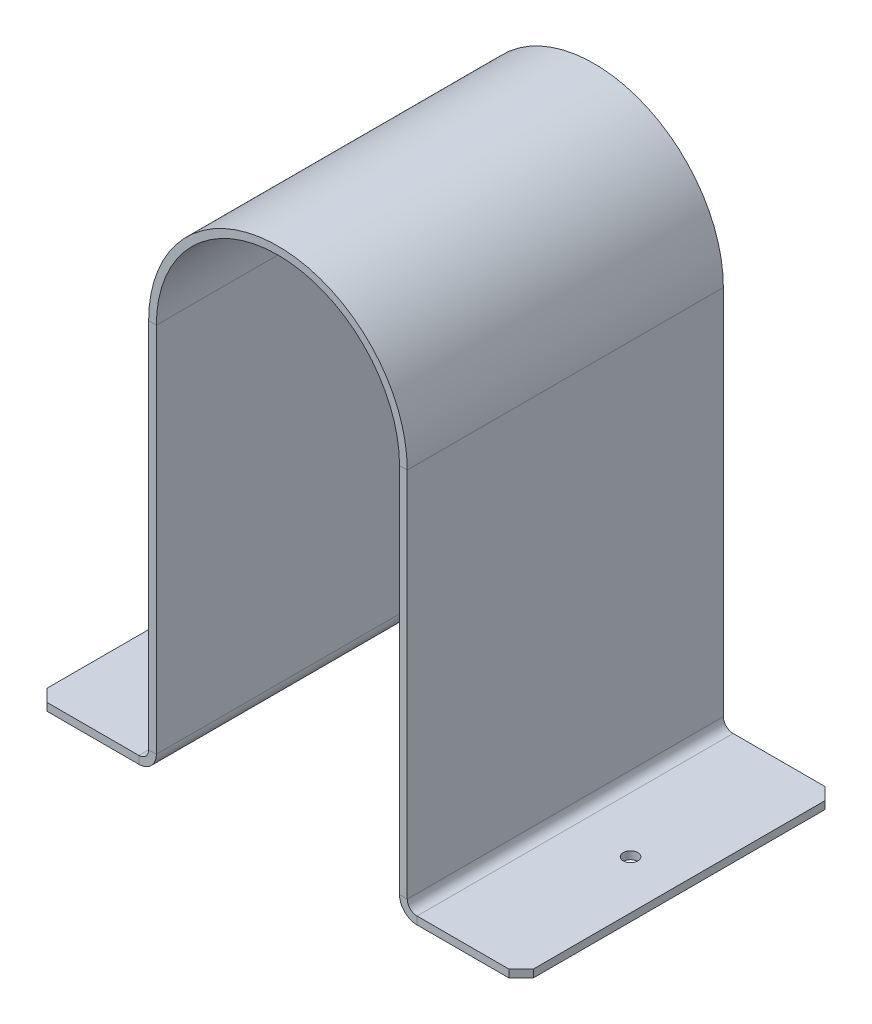
ISO-10303-21;
HEADER;
FILE_DESCRIPTION(('STEP AP214'),'2;1');
FILE_NAME('part.step','',(''),(''),'','','');
FILE_SCHEMA(('AUTOMOTIVE_DESIGN { 1 0 10303 214 1 1 1 1 }'));
ENDSEC;
DATA;
#1=APPLICATION_CONTEXT('core data for automotive mechanical design processes');
#2=APPLICATION_PROTOCOL_DEFINITION('international standard','automotive_design',2000,#1);
#3=PRODUCT_CONTEXT('',#1,'mechanical');
#4=PRODUCT('Part','Part','',(#3));
#5=PRODUCT_RELATED_PRODUCT_CATEGORY('part','',(#4));
#6=PRODUCT_DEFINITION_FORMATION('','',#4);
#7=PRODUCT_DEFINITION_CONTEXT('part definition',#1,'design');
#8=PRODUCT_DEFINITION('design','',#6,#7);
#9=PRODUCT_DEFINITION_SHAPE('','',#8);
#10=(LENGTH_UNIT() NAMED_UNIT(*) SI_UNIT(.MILLI.,.METRE.));
#11=(NAMED_UNIT(*) PLANE_ANGLE_UNIT() SI_UNIT($,.RADIAN.));
#12=(NAMED_UNIT(*) SI_UNIT($,.STERADIAN.) SOLID_ANGLE_UNIT());
#13=UNCERTAINTY_MEASURE_WITH_UNIT(LENGTH_MEASURE(1.E-05),#10,'distance_accuracy_value','');
#14=(GEOMETRIC_REPRESENTATION_CONTEXT(3) GLOBAL_UNCERTAINTY_ASSIGNED_CONTEXT((#13)) GLOBAL_UNIT_ASSIGNED_CONTEXT((#10,
#11,#12)) REPRESENTATION_CONTEXT('',''));
#15=CARTESIAN_POINT('',(0.,0.,0.));
#16=DIRECTION('',(0.,0.,1.));
#17=DIRECTION('',(1.,0.,0.));
#18=AXIS2_PLACEMENT_3D('',#15,#16,#17);
#19=CARTESIAN_POINT('',(-50.,160.,65.));
#20=DIRECTION('',(0.,0.,1.));
#21=DIRECTION('',(1.,0.,0.));
#22=AXIS2_PLACEMENT_3D('',#19,#20,#21);
#23=PLANE('',#22);
#24=DIRECTION('',(-1.,0.,0.));
#25=VECTOR('',#24,1.);
#26=CARTESIAN_POINT('',(-50.,160.,65.));
#27=LINE('',#26,#25);
#28=CARTESIAN_POINT('',(-50.,160.,65.));
#29=VERTEX_POINT('',#28);
#30=CARTESIAN_POINT('',(-53.175,160.,65.));
#31=VERTEX_POINT('',#30);
#32=EDGE_CURVE('E350',#29,#31,#27,.T.);
#33=ORIENTED_EDGE('',*,*,#32,.F.);
#34=CARTESIAN_POINT('',(0.,160.,65.));
#35=DIRECTION('',(0.,0.,-1.));
#36=DIRECTION('',(-1.,0.,0.));
#37=AXIS2_PLACEMENT_3D('',#34,#35,#36);
#38=CIRCLE('',#37,50.);
#39=CARTESIAN_POINT('',(50.,160.,65.));
#40=VERTEX_POINT('',#39);
#41=EDGE_CURVE('E246',#29,#40,#38,.T.);
#42=ORIENTED_EDGE('',*,*,#41,.T.);
#43=DIRECTION('',(-1.,0.,0.));
#44=VECTOR('',#43,1.);
#45=CARTESIAN_POINT('',(53.175,160.,65.));
#46=LINE('',#45,#44);
#47=CARTESIAN_POINT('',(53.175,160.,65.));
#48=VERTEX_POINT('',#47);
#49=EDGE_CURVE('E348',#48,#40,#46,.T.);
#50=ORIENTED_EDGE('',*,*,#49,.F.);
#51=CARTESIAN_POINT('',(0.,160.,65.));
#52=DIRECTION('',(0.,0.,1.));
#53=DIRECTION('',(1.,0.,0.));
#54=AXIS2_PLACEMENT_3D('',#51,#52,#53);
#55=CIRCLE('',#54,53.175);
#56=EDGE_CURVE('E224',#31,#48,#55,.F.);
#57=ORIENTED_EDGE('',*,*,#56,.F.);
#58=EDGE_LOOP('',(#33,#42,#50,#57));
#59=FACE_BOUND('',#58,.T.);
#60=ADVANCED_FACE('F43',(#59),#23,.T.);
#61=CARTESIAN_POINT('',(53.175,160.,65.));
#62=DIRECTION('',(0.,0.,1.));
#63=DIRECTION('',(1.,0.,0.));
#64=AXIS2_PLACEMENT_3D('',#61,#62,#63);
#65=PLANE('',#64);
#66=DIRECTION('',(0.,1.,0.));
#67=VECTOR('',#66,1.);
#68=CARTESIAN_POINT('',(-50.,0.,65.));
#69=LINE('',#68,#67);
#70=CARTESIAN_POINT('',(-50.,7.175,65.));
#71=VERTEX_POINT('',#70);
#72=EDGE_CURVE('E243',#71,#29,#69,.T.);
#73=ORIENTED_EDGE('',*,*,#72,.T.);
#74=ORIENTED_EDGE('',*,*,#32,.T.);
#75=DIRECTION('',(0.,1.,0.));
#76=VECTOR('',#75,1.);
#77=CARTESIAN_POINT('',(-53.175,0.,65.));
#78=LINE('',#77,#76);
#79=CARTESIAN_POINT('',(-53.175,7.175,65.));
#80=VERTEX_POINT('',#79);
#81=EDGE_CURVE('E230',#80,#31,#78,.T.);
#82=ORIENTED_EDGE('',*,*,#81,.F.);
#83=DIRECTION('',(1.,0.,0.));
#84=VECTOR('',#83,1.);
#85=CARTESIAN_POINT('',(-53.175,7.175,65.));
#86=LINE('',#85,#84);
#87=EDGE_CURVE('E339',#80,#71,#86,.T.);
#88=ORIENTED_EDGE('',*,*,#87,.T.);
#89=EDGE_LOOP('',(#73,#74,#82,#88));
#90=FACE_BOUND('',#89,.T.);
#91=ADVANCED_FACE('F421',(#90),#65,.T.);
#92=CARTESIAN_POINT('',(50.,160.,-65.));
#93=DIRECTION('',(0.,0.,-1.));
#94=DIRECTION('',(-1.,0.,0.));
#95=AXIS2_PLACEMENT_3D('',#92,#93,#94);
#96=PLANE('',#95);
#97=DIRECTION('',(1.,0.,0.));
#98=VECTOR('',#97,1.);
#99=CARTESIAN_POINT('',(50.,160.,-65.));
#100=LINE('',#99,#98);
#101=CARTESIAN_POINT('',(50.,160.,-65.));
#102=VERTEX_POINT('',#101);
#103=CARTESIAN_POINT('',(53.175,160.,-65.));
#104=VERTEX_POINT('',#103);
#105=EDGE_CURVE('E346',#102,#104,#100,.T.);
#106=ORIENTED_EDGE('',*,*,#105,.F.);
#107=CARTESIAN_POINT('',(0.,160.,-65.));
#108=DIRECTION('',(0.,0.,-1.));
#109=DIRECTION('',(-1.,0.,0.));
#110=AXIS2_PLACEMENT_3D('',#107,#108,#109);
#111=CIRCLE('',#110,50.);
#112=CARTESIAN_POINT('',(-50.,160.,-65.));
#113=VERTEX_POINT('',#112);
#114=EDGE_CURVE('E283',#113,#102,#111,.T.);
#115=ORIENTED_EDGE('',*,*,#114,.F.);
#116=DIRECTION('',(1.,0.,0.));
#117=VECTOR('',#116,1.);
#118=CARTESIAN_POINT('',(-53.175,160.,-65.));
#119=LINE('',#118,#117);
#120=CARTESIAN_POINT('',(-53.175,160.,-65.));
#121=VERTEX_POINT('',#120);
#122=EDGE_CURVE('E344',#121,#113,#119,.T.);
#123=ORIENTED_EDGE('',*,*,#122,.F.);
#124=CARTESIAN_POINT('',(0.,160.,-65.));
#125=DIRECTION('',(0.,0.,1.));
#126=DIRECTION('',(1.,0.,0.));
#127=AXIS2_PLACEMENT_3D('',#124,#125,#126);
#128=CIRCLE('',#127,53.175);
#129=EDGE_CURVE('E264',#121,#104,#128,.F.);
#130=ORIENTED_EDGE('',*,*,#129,.T.);
#131=EDGE_LOOP('',(#106,#115,#123,#130));
#132=FACE_BOUND('',#131,.T.);
#133=ADVANCED_FACE('F479',(#132),#96,.T.);
#134=CARTESIAN_POINT('',(-53.175,160.,-65.));
#135=DIRECTION('',(0.,0.,-1.));
#136=DIRECTION('',(-1.,0.,0.));
#137=AXIS2_PLACEMENT_3D('',#134,#135,#136);
#138=PLANE('',#137);
#139=DIRECTION('',(0.,-1.,0.));
#140=VECTOR('',#139,1.);
#141=CARTESIAN_POINT('',(50.,160.,-65.));
#142=LINE('',#141,#140);
#143=CARTESIAN_POINT('',(50.,7.17499999999999,-65.));
#144=VERTEX_POINT('',#143);
#145=EDGE_CURVE('E286',#102,#144,#142,.T.);
#146=ORIENTED_EDGE('',*,*,#145,.F.);
#147=ORIENTED_EDGE('',*,*,#105,.T.);
#148=DIRECTION('',(0.,-1.,0.));
#149=VECTOR('',#148,1.);
#150=CARTESIAN_POINT('',(53.175,160.,-65.));
#151=LINE('',#150,#149);
#152=CARTESIAN_POINT('',(53.175,7.17499999999999,-65.));
#153=VERTEX_POINT('',#152);
#154=EDGE_CURVE('E261',#104,#153,#151,.T.);
#155=ORIENTED_EDGE('',*,*,#154,.T.);
#156=DIRECTION('',(-1.,0.,0.));
#157=VECTOR('',#156,1.);
#158=CARTESIAN_POINT('',(53.175,7.17499999999999,-65.));
#159=LINE('',#158,#157);
#160=EDGE_CURVE('E330',#153,#144,#159,.T.);
#161=ORIENTED_EDGE('',*,*,#160,.T.);
#162=EDGE_LOOP('',(#146,#147,#155,#161));
#163=FACE_BOUND('',#162,.T.);
#164=ADVANCED_FACE('F784',(#163),#138,.T.);
#165=CARTESIAN_POINT('',(-57.175,0.,65.));
#166=DIRECTION('',(0.,0.,1.));
#167=DIRECTION('',(1.,0.,0.));
#168=AXIS2_PLACEMENT_3D('',#165,#166,#167);
#169=PLANE('',#168);
#170=DIRECTION('',(0.,1.,0.));
#171=VECTOR('',#170,1.);
#172=CARTESIAN_POINT('',(-57.175,0.,65.));
#173=LINE('',#172,#171);
#174=CARTESIAN_POINT('',(-57.175,0.,65.));
#175=VERTEX_POINT('',#174);
#176=CARTESIAN_POINT('',(-57.175,3.175,65.));
#177=VERTEX_POINT('',#176);
#178=EDGE_CURVE('E341',#175,#177,#173,.T.);
#179=ORIENTED_EDGE('',*,*,#178,.F.);
#180=CARTESIAN_POINT('',(-57.175,7.175,65.));
#181=DIRECTION('',(0.,0.,-1.));
#182=DIRECTION('',(-1.,0.,0.));
#183=AXIS2_PLACEMENT_3D('',#180,#181,#182);
#184=CIRCLE('',#183,7.175);
#185=EDGE_CURVE('E240',#175,#71,#184,.F.);
#186=ORIENTED_EDGE('',*,*,#185,.T.);
#187=ORIENTED_EDGE('',*,*,#87,.F.);
#188=CARTESIAN_POINT('',(-57.175,7.175,65.));
#189=DIRECTION('',(0.,0.,1.));
#190=DIRECTION('',(1.,0.,0.));
#191=AXIS2_PLACEMENT_3D('',#188,#189,#190);
#192=CIRCLE('',#191,4.);
#193=EDGE_CURVE('E233',#177,#80,#192,.T.);
#194=ORIENTED_EDGE('',*,*,#193,.F.);
#195=EDGE_LOOP('',(#179,#186,#187,#194));
#196=FACE_BOUND('',#195,.T.);
#197=ADVANCED_FACE('F412',(#196),#169,.T.);
#198=CARTESIAN_POINT('',(-53.175,7.175,65.));
#199=DIRECTION('',(0.,0.,1.));
#200=DIRECTION('',(1.,0.,0.));
#201=AXIS2_PLACEMENT_3D('',#198,#199,#200);
#202=PLANE('',#201);
#203=DIRECTION('',(1.,0.,0.));
#204=VECTOR('',#203,1.);
#205=CARTESIAN_POINT('',(-100.,3.175,65.));
#206=LINE('',#205,#204);
#207=CARTESIAN_POINT('',(-95.,3.175,65.));
#208=VERTEX_POINT('',#207);
#209=EDGE_CURVE('E236',#208,#177,#206,.T.);
#210=ORIENTED_EDGE('',*,*,#209,.F.);
#211=DIRECTION('',(0.,-1.,0.));
#212=VECTOR('',#211,1.);
#213=CARTESIAN_POINT('',(-95.,7.175,65.));
#214=LINE('',#213,#212);
#215=CARTESIAN_POINT('',(-95.,0.,65.));
#216=VERTEX_POINT('',#215);
#217=EDGE_CURVE('E11',#208,#216,#214,.T.);
#218=ORIENTED_EDGE('',*,*,#217,.T.);
#219=DIRECTION('',(1.,0.,0.));
#220=VECTOR('',#219,1.);
#221=CARTESIAN_POINT('',(-100.,0.,65.));
#222=LINE('',#221,#220);
#223=EDGE_CURVE('E238',#216,#175,#222,.T.);
#224=ORIENTED_EDGE('',*,*,#223,.T.);
#225=ORIENTED_EDGE('',*,*,#178,.T.);
#226=EDGE_LOOP('',(#210,#218,#224,#225));
#227=FACE_BOUND('',#226,.T.);
#228=ADVANCED_FACE('F404',(#227),#202,.T.);
#229=CARTESIAN_POINT('',(-50.,7.175,-65.));
#230=DIRECTION('',(0.,0.,-1.));
#231=DIRECTION('',(-1.,0.,0.));
#232=AXIS2_PLACEMENT_3D('',#229,#230,#231);
#233=PLANE('',#232);
#234=DIRECTION('',(-1.,0.,0.));
#235=VECTOR('',#234,1.);
#236=CARTESIAN_POINT('',(-50.,7.175,-65.));
#237=LINE('',#236,#235);
#238=CARTESIAN_POINT('',(-50.,7.175,-65.));
#239=VERTEX_POINT('',#238);
#240=CARTESIAN_POINT('',(-53.175,7.175,-65.));
#241=VERTEX_POINT('',#240);
#242=EDGE_CURVE('E337',#239,#241,#237,.T.);
#243=ORIENTED_EDGE('',*,*,#242,.F.);
#244=CARTESIAN_POINT('',(-57.175,7.175,-65.));
#245=DIRECTION('',(0.,0.,-1.));
#246=DIRECTION('',(-1.,0.,0.));
#247=AXIS2_PLACEMENT_3D('',#244,#245,#246);
#248=CIRCLE('',#247,7.175);
#249=CARTESIAN_POINT('',(-57.175,0.,-65.));
#250=VERTEX_POINT('',#249);
#251=EDGE_CURVE('E277',#250,#239,#248,.F.);
#252=ORIENTED_EDGE('',*,*,#251,.F.);
#253=DIRECTION('',(0.,-1.,0.));
#254=VECTOR('',#253,1.);
#255=CARTESIAN_POINT('',(-57.175,3.175,-65.));
#256=LINE('',#255,#254);
#257=CARTESIAN_POINT('',(-57.175,3.175,-65.));
#258=VERTEX_POINT('',#257);
#259=EDGE_CURVE('E334',#258,#250,#256,.T.);
#260=ORIENTED_EDGE('',*,*,#259,.F.);
#261=CARTESIAN_POINT('',(-57.175,7.175,-65.));
#262=DIRECTION('',(0.,0.,1.));
#263=DIRECTION('',(1.,0.,0.));
#264=AXIS2_PLACEMENT_3D('',#261,#262,#263);
#265=CIRCLE('',#264,4.);
#266=EDGE_CURVE('E270',#258,#241,#265,.T.);
#267=ORIENTED_EDGE('',*,*,#266,.T.);
#268=EDGE_LOOP('',(#243,#252,#260,#267));
#269=FACE_BOUND('',#268,.T.);
#270=ADVANCED_FACE('F626',(#269),#233,.T.);
#271=CARTESIAN_POINT('',(-57.175,3.175,-65.));
#272=DIRECTION('',(0.,0.,-1.));
#273=DIRECTION('',(-1.,0.,0.));
#274=AXIS2_PLACEMENT_3D('',#271,#272,#273);
#275=PLANE('',#274);
#276=DIRECTION('',(0.,1.,0.));
#277=VECTOR('',#276,1.);
#278=CARTESIAN_POINT('',(-50.,0.,-65.));
#279=LINE('',#278,#277);
#280=EDGE_CURVE('E280',#239,#113,#279,.T.);
#281=ORIENTED_EDGE('',*,*,#280,.F.);
#282=ORIENTED_EDGE('',*,*,#242,.T.);
#283=DIRECTION('',(0.,1.,0.));
#284=VECTOR('',#283,1.);
#285=CARTESIAN_POINT('',(-53.175,0.,-65.));
#286=LINE('',#285,#284);
#287=EDGE_CURVE('E267',#241,#121,#286,.T.);
#288=ORIENTED_EDGE('',*,*,#287,.T.);
#289=ORIENTED_EDGE('',*,*,#122,.T.);
#290=EDGE_LOOP('',(#281,#282,#288,#289));
#291=FACE_BOUND('',#290,.T.);
#292=ADVANCED_FACE('F758',(#291),#275,.T.);
#293=CARTESIAN_POINT('',(50.,7.17499999999999,65.));
#294=DIRECTION('',(0.,0.,1.));
#295=DIRECTION('',(1.,0.,0.));
#296=AXIS2_PLACEMENT_3D('',#293,#294,#295);
#297=PLANE('',#296);
#298=DIRECTION('',(1.,0.,0.));
#299=VECTOR('',#298,1.);
#300=CARTESIAN_POINT('',(50.,7.17499999999999,65.));
#301=LINE('',#300,#299);
#302=CARTESIAN_POINT('',(50.,7.17499999999999,65.));
#303=VERTEX_POINT('',#302);
#304=CARTESIAN_POINT('',(53.175,7.17499999999999,65.));
#305=VERTEX_POINT('',#304);
#306=EDGE_CURVE('E194',#303,#305,#301,.T.);
#307=ORIENTED_EDGE('',*,*,#306,.F.);
#308=CARTESIAN_POINT('',(57.175,7.17499999999999,65.));
#309=DIRECTION('',(0.,0.,-1.));
#310=DIRECTION('',(-1.,0.,0.));
#311=AXIS2_PLACEMENT_3D('',#308,#309,#310);
#312=CIRCLE('',#311,7.175);
#313=CARTESIAN_POINT('',(57.175,0.,65.));
#314=VERTEX_POINT('',#313);
#315=EDGE_CURVE('E189',#303,#314,#312,.F.);
#316=ORIENTED_EDGE('',*,*,#315,.T.);
#317=DIRECTION('',(0.,-1.,0.));
#318=VECTOR('',#317,1.);
#319=CARTESIAN_POINT('',(57.175,3.175,65.));
#320=LINE('',#319,#318);
#321=CARTESIAN_POINT('',(57.175,3.175,65.));
#322=VERTEX_POINT('',#321);
#323=EDGE_CURVE('E182',#322,#314,#320,.T.);
#324=ORIENTED_EDGE('',*,*,#323,.F.);
#325=CARTESIAN_POINT('',(57.175,7.17499999999999,65.));
#326=DIRECTION('',(0.,0.,1.));
#327=DIRECTION('',(1.,0.,0.));
#328=AXIS2_PLACEMENT_3D('',#325,#326,#327);
#329=CIRCLE('',#328,4.);
#330=EDGE_CURVE('E186',#305,#322,#329,.T.);
#331=ORIENTED_EDGE('',*,*,#330,.F.);
#332=EDGE_LOOP('',(#307,#316,#324,#331));
#333=FACE_BOUND('',#332,.T.);
#334=ADVANCED_FACE('F184',(#333),#297,.T.);
#335=CARTESIAN_POINT('',(57.175,3.175,65.));
#336=DIRECTION('',(0.,0.,1.));
#337=DIRECTION('',(1.,0.,0.));
#338=AXIS2_PLACEMENT_3D('',#335,#336,#337);
#339=PLANE('',#338);
#340=DIRECTION('',(0.,-1.,0.));
#341=VECTOR('',#340,1.);
#342=CARTESIAN_POINT('',(50.,160.,65.));
#343=LINE('',#342,#341);
#344=EDGE_CURVE('E249',#40,#303,#343,.T.);
#345=ORIENTED_EDGE('',*,*,#344,.T.);
#346=ORIENTED_EDGE('',*,*,#306,.T.);
#347=DIRECTION('',(0.,-1.,0.));
#348=VECTOR('',#347,1.);
#349=CARTESIAN_POINT('',(53.175,160.,65.));
#350=LINE('',#349,#348);
#351=EDGE_CURVE('E222',#48,#305,#350,.T.);
#352=ORIENTED_EDGE('',*,*,#351,.F.);
#353=ORIENTED_EDGE('',*,*,#49,.T.);
#354=EDGE_LOOP('',(#345,#346,#352,#353));
#355=FACE_BOUND('',#354,.T.);
#356=ADVANCED_FACE('F438',(#355),#339,.T.);
#357=CARTESIAN_POINT('',(57.175,0.,-65.));
#358=DIRECTION('',(0.,0.,-1.));
#359=DIRECTION('',(-1.,0.,0.));
#360=AXIS2_PLACEMENT_3D('',#357,#358,#359);
#361=PLANE('',#360);
#362=DIRECTION('',(0.,1.,0.));
#363=VECTOR('',#362,1.);
#364=CARTESIAN_POINT('',(57.175,0.,-65.));
#365=LINE('',#364,#363);
#366=CARTESIAN_POINT('',(57.175,0.,-65.));
#367=VERTEX_POINT('',#366);
#368=CARTESIAN_POINT('',(57.175,3.175,-65.));
#369=VERTEX_POINT('',#368);
#370=EDGE_CURVE('E195',#367,#369,#365,.T.);
#371=ORIENTED_EDGE('',*,*,#370,.F.);
#372=CARTESIAN_POINT('',(57.175,7.17499999999999,-65.));
#373=DIRECTION('',(0.,0.,-1.));
#374=DIRECTION('',(-1.,0.,0.));
#375=AXIS2_PLACEMENT_3D('',#372,#373,#374);
#376=CIRCLE('',#375,7.175);
#377=EDGE_CURVE('E289',#144,#367,#376,.F.);
#378=ORIENTED_EDGE('',*,*,#377,.F.);
#379=ORIENTED_EDGE('',*,*,#160,.F.);
#380=CARTESIAN_POINT('',(57.175,7.17499999999999,-65.));
#381=DIRECTION('',(0.,0.,1.));
#382=DIRECTION('',(1.,0.,0.));
#383=AXIS2_PLACEMENT_3D('',#380,#381,#382);
#384=CIRCLE('',#383,4.);
#385=EDGE_CURVE('E259',#153,#369,#384,.T.);
#386=ORIENTED_EDGE('',*,*,#385,.T.);
#387=EDGE_LOOP('',(#371,#378,#379,#386));
#388=FACE_BOUND('',#387,.T.);
#389=ADVANCED_FACE('F613',(#388),#361,.T.);
#390=CARTESIAN_POINT('',(53.175,7.17499999999999,-65.));
#391=DIRECTION('',(0.,0.,-1.));
#392=DIRECTION('',(-1.,0.,0.));
#393=AXIS2_PLACEMENT_3D('',#390,#391,#392);
#394=PLANE('',#393);
#395=DIRECTION('',(1.,0.,0.));
#396=VECTOR('',#395,1.);
#397=CARTESIAN_POINT('',(50.,3.175,-65.));
#398=LINE('',#397,#396);
#399=CARTESIAN_POINT('',(95.,3.175,-65.));
#400=VERTEX_POINT('',#399);
#401=EDGE_CURVE('E207',#369,#400,#398,.T.);
#402=ORIENTED_EDGE('',*,*,#401,.T.);
#403=DIRECTION('',(0.,-1.,0.));
#404=VECTOR('',#403,1.);
#405=CARTESIAN_POINT('',(95.,7.17499999999999,-65.));
#406=LINE('',#405,#404);
#407=CARTESIAN_POINT('',(95.,0.,-65.));
#408=VERTEX_POINT('',#407);
#409=EDGE_CURVE('E352',#400,#408,#406,.T.);
#410=ORIENTED_EDGE('',*,*,#409,.T.);
#411=DIRECTION('',(1.,0.,0.));
#412=VECTOR('',#411,1.);
#413=CARTESIAN_POINT('',(50.,0.,-65.));
#414=LINE('',#413,#412);
#415=EDGE_CURVE('E254',#367,#408,#414,.T.);
#416=ORIENTED_EDGE('',*,*,#415,.F.);
#417=ORIENTED_EDGE('',*,*,#370,.T.);
#418=EDGE_LOOP('',(#402,#410,#416,#417));
#419=FACE_BOUND('',#418,.T.);
#420=ADVANCED_FACE('F602',(#419),#394,.T.);
#421=CARTESIAN_POINT('',(50.,0.,65.));
#422=DIRECTION('',(0.,1.,0.));
#423=DIRECTION('',(0.,0.,1.));
#424=AXIS2_PLACEMENT_3D('',#421,#422,#423);
#425=PLANE('',#424);
#426=CARTESIAN_POINT('',(80.,0.,0.));
#427=DIRECTION('',(0.,1.,0.));
#428=DIRECTION('',(0.,0.,1.));
#429=AXIS2_PLACEMENT_3D('',#426,#427,#428);
#430=CIRCLE('',#429,3.00000000000001);
#431=CARTESIAN_POINT('',(80.,0.,3.00000000000001));
#432=VERTEX_POINT('',#431);
#433=EDGE_CURVE('E257',#432,#432,#430,.T.);
#434=ORIENTED_EDGE('',*,*,#433,.T.);
#435=EDGE_LOOP('',(#434));
#436=FACE_BOUND('',#435,.T.);
#437=ORIENTED_EDGE('',*,*,#415,.T.);
#438=DIRECTION('',(-0.707106781186548,0.,-0.707106781186548));
#439=VECTOR('',#438,1.);
#440=CARTESIAN_POINT('',(95.,0.,-65.));
#441=LINE('',#440,#439);
#442=CARTESIAN_POINT('',(100.,0.,-60.));
#443=VERTEX_POINT('',#442);
#444=EDGE_CURVE('E361',#408,#443,#441,.F.);
#445=ORIENTED_EDGE('',*,*,#444,.T.);
#446=DIRECTION('',(0.,0.,-1.));
#447=VECTOR('',#446,1.);
#448=CARTESIAN_POINT('',(100.,0.,65.));
#449=LINE('',#448,#447);
#450=CARTESIAN_POINT('',(100.,0.,60.));
#451=VERTEX_POINT('',#450);
#452=EDGE_CURVE('E327',#451,#443,#449,.T.);
#453=ORIENTED_EDGE('',*,*,#452,.F.);
#454=DIRECTION('',(0.707106781186548,0.,-0.707106781186548));
#455=VECTOR('',#454,1.);
#456=CARTESIAN_POINT('',(100.,0.,60.));
#457=LINE('',#456,#455);
#458=CARTESIAN_POINT('',(95.,0.,65.));
#459=VERTEX_POINT('',#458);
#460=EDGE_CURVE('E359',#451,#459,#457,.F.);
#461=ORIENTED_EDGE('',*,*,#460,.T.);
#462=DIRECTION('',(1.,0.,0.));
#463=VECTOR('',#462,1.);
#464=CARTESIAN_POINT('',(50.,0.,65.));
#465=LINE('',#464,#463);
#466=EDGE_CURVE('E217',#314,#459,#465,.T.);
#467=ORIENTED_EDGE('',*,*,#466,.F.);
#468=DIRECTION('',(0.,0.,-1.));
#469=VECTOR('',#468,1.);
#470=CARTESIAN_POINT('',(57.175,0.,65.));
#471=LINE('',#470,#469);
#472=EDGE_CURVE('E253',#314,#367,#471,.T.);
#473=ORIENTED_EDGE('',*,*,#472,.T.);
#474=EDGE_LOOP('',(#437,#445,#453,#461,#467,#473));
#475=FACE_BOUND('',#474,.T.);
#476=ADVANCED_FACE('F450',(#436,#475),#425,.F.);
#477=CARTESIAN_POINT('',(100.,3.175,65.));
#478=DIRECTION('',(1.,0.,0.));
#479=DIRECTION('',(0.,0.,-1.));
#480=AXIS2_PLACEMENT_3D('',#477,#478,#479);
#481=PLANE('',#480);
#482=ORIENTED_EDGE('',*,*,#452,.T.);
#483=DIRECTION('',(0.,1.,0.));
#484=VECTOR('',#483,1.);
#485=CARTESIAN_POINT('',(100.,3.175,-60.));
#486=LINE('',#485,#484);
#487=CARTESIAN_POINT('',(100.,3.175,-60.));
#488=VERTEX_POINT('',#487);
#489=EDGE_CURVE('E366',#443,#488,#486,.T.);
#490=ORIENTED_EDGE('',*,*,#489,.T.);
#491=DIRECTION('',(0.,0.,-1.));
#492=VECTOR('',#491,1.);
#493=CARTESIAN_POINT('',(100.,3.175,65.));
#494=LINE('',#493,#492);
#495=CARTESIAN_POINT('',(100.,3.175,60.));
#496=VERTEX_POINT('',#495);
#497=EDGE_CURVE('E211',#496,#488,#494,.T.);
#498=ORIENTED_EDGE('',*,*,#497,.F.);
#499=DIRECTION('',(0.,-1.,0.));
#500=VECTOR('',#499,1.);
#501=CARTESIAN_POINT('',(100.,3.175,60.));
#502=LINE('',#501,#500);
#503=EDGE_CURVE('E363',#496,#451,#502,.T.);
#504=ORIENTED_EDGE('',*,*,#503,.T.);
#505=EDGE_LOOP('',(#482,#490,#498,#504));
#506=FACE_BOUND('',#505,.T.);
#507=ADVANCED_FACE('F465',(#506),#481,.T.);
#508=CARTESIAN_POINT('',(50.,3.175,65.));
#509=DIRECTION('',(0.,1.,0.));
#510=DIRECTION('',(0.,0.,1.));
#511=AXIS2_PLACEMENT_3D('',#508,#509,#510);
#512=PLANE('',#511);
#513=CARTESIAN_POINT('',(80.,3.175,0.));
#514=DIRECTION('',(0.,1.,0.));
#515=DIRECTION('',(0.,0.,1.));
#516=AXIS2_PLACEMENT_3D('',#513,#514,#515);
#517=CIRCLE('',#516,3.00000000000001);
#518=CARTESIAN_POINT('',(80.,3.175,3.00000000000001));
#519=VERTEX_POINT('',#518);
#520=EDGE_CURVE('E356',#519,#519,#517,.T.);
#521=ORIENTED_EDGE('',*,*,#520,.F.);
#522=EDGE_LOOP('',(#521));
#523=FACE_BOUND('',#522,.T.);
#524=ORIENTED_EDGE('',*,*,#497,.T.);
#525=DIRECTION('',(0.707106781186548,0.,0.707106781186548));
#526=VECTOR('',#525,1.);
#527=CARTESIAN_POINT('',(137.5,3.175,-22.5));
#528=LINE('',#527,#526);
#529=EDGE_CURVE('E370',#488,#400,#528,.F.);
#530=ORIENTED_EDGE('',*,*,#529,.T.);
#531=ORIENTED_EDGE('',*,*,#401,.F.);
#532=DIRECTION('',(0.,0.,-1.));
#533=VECTOR('',#532,1.);
#534=CARTESIAN_POINT('',(57.175,3.175,65.));
#535=LINE('',#534,#533);
#536=EDGE_CURVE('E201',#322,#369,#535,.T.);
#537=ORIENTED_EDGE('',*,*,#536,.F.);
#538=DIRECTION('',(1.,0.,0.));
#539=VECTOR('',#538,1.);
#540=CARTESIAN_POINT('',(50.,3.175,65.));
#541=LINE('',#540,#539);
#542=CARTESIAN_POINT('',(95.,3.175,65.));
#543=VERTEX_POINT('',#542);
#544=EDGE_CURVE('E204',#322,#543,#541,.T.);
#545=ORIENTED_EDGE('',*,*,#544,.T.);
#546=DIRECTION('',(-0.707106781186548,0.,0.707106781186548));
#547=VECTOR('',#546,1.);
#548=CARTESIAN_POINT('',(72.5,3.175,87.5));
#549=LINE('',#548,#547);
#550=EDGE_CURVE('E368',#543,#496,#549,.F.);
#551=ORIENTED_EDGE('',*,*,#550,.T.);
#552=EDGE_LOOP('',(#524,#530,#531,#537,#545,#551));
#553=FACE_BOUND('',#552,.T.);
#554=ADVANCED_FACE('F203',(#523,#553),#512,.T.);
#555=CARTESIAN_POINT('',(57.175,7.17499999999999,65.));
#556=DIRECTION('',(0.,0.,-1.));
#557=DIRECTION('',(-1.,0.,0.));
#558=AXIS2_PLACEMENT_3D('',#555,#556,#557);
#559=CYLINDRICAL_SURFACE('',#558,4.);
#560=ORIENTED_EDGE('',*,*,#385,.F.);
#561=DIRECTION('',(0.,0.,-1.));
#562=VECTOR('',#561,1.);
#563=CARTESIAN_POINT('',(53.175,7.17499999999999,65.));
#564=LINE('',#563,#562);
#565=EDGE_CURVE('E212',#305,#153,#564,.T.);
#566=ORIENTED_EDGE('',*,*,#565,.F.);
#567=ORIENTED_EDGE('',*,*,#330,.T.);
#568=ORIENTED_EDGE('',*,*,#536,.T.);
#569=EDGE_LOOP('',(#560,#566,#567,#568));
#570=FACE_BOUND('',#569,.T.);
#571=ADVANCED_FACE('F220',(#570),#559,.F.);
#572=CARTESIAN_POINT('',(53.175,160.,65.));
#573=DIRECTION('',(1.,0.,0.));
#574=DIRECTION('',(0.,1.,0.));
#575=AXIS2_PLACEMENT_3D('',#572,#573,#574);
#576=PLANE('',#575);
#577=ORIENTED_EDGE('',*,*,#154,.F.);
#578=DIRECTION('',(0.,0.,-1.));
#579=VECTOR('',#578,1.);
#580=CARTESIAN_POINT('',(53.175,160.,65.));
#581=LINE('',#580,#579);
#582=EDGE_CURVE('E322',#48,#104,#581,.T.);
#583=ORIENTED_EDGE('',*,*,#582,.F.);
#584=ORIENTED_EDGE('',*,*,#351,.T.);
#585=ORIENTED_EDGE('',*,*,#565,.T.);
#586=EDGE_LOOP('',(#577,#583,#584,#585));
#587=FACE_BOUND('',#586,.T.);
#588=ADVANCED_FACE('F437',(#587),#576,.T.);
#589=CARTESIAN_POINT('',(0.,160.,65.));
#590=DIRECTION('',(0.,0.,-1.));
#591=DIRECTION('',(-1.,0.,0.));
#592=AXIS2_PLACEMENT_3D('',#589,#590,#591);
#593=CYLINDRICAL_SURFACE('',#592,53.175);
#594=ORIENTED_EDGE('',*,*,#129,.F.);
#595=DIRECTION('',(0.,0.,-1.));
#596=VECTOR('',#595,1.);
#597=CARTESIAN_POINT('',(-53.175,160.,65.));
#598=LINE('',#597,#596);
#599=EDGE_CURVE('E319',#31,#121,#598,.T.);
#600=ORIENTED_EDGE('',*,*,#599,.F.);
#601=ORIENTED_EDGE('',*,*,#56,.T.);
#602=ORIENTED_EDGE('',*,*,#582,.T.);
#603=EDGE_LOOP('',(#594,#600,#601,#602));
#604=FACE_BOUND('',#603,.T.);
#605=ADVANCED_FACE('F429',(#604),#593,.T.);
#606=CARTESIAN_POINT('',(-53.175,0.,65.));
#607=DIRECTION('',(-1.,0.,0.));
#608=DIRECTION('',(0.,0.,1.));
#609=AXIS2_PLACEMENT_3D('',#606,#607,#608);
#610=PLANE('',#609);
#611=ORIENTED_EDGE('',*,*,#287,.F.);
#612=DIRECTION('',(0.,0.,-1.));
#613=VECTOR('',#612,1.);
#614=CARTESIAN_POINT('',(-53.175,7.175,65.));
#615=LINE('',#614,#613);
#616=EDGE_CURVE('E316',#80,#241,#615,.T.);
#617=ORIENTED_EDGE('',*,*,#616,.F.);
#618=ORIENTED_EDGE('',*,*,#81,.T.);
#619=ORIENTED_EDGE('',*,*,#599,.T.);
#620=EDGE_LOOP('',(#611,#617,#618,#619));
#621=FACE_BOUND('',#620,.T.);
#622=ADVANCED_FACE('F420',(#621),#610,.T.);
#623=CARTESIAN_POINT('',(-57.175,7.175,65.));
#624=DIRECTION('',(0.,0.,-1.));
#625=DIRECTION('',(-1.,0.,0.));
#626=AXIS2_PLACEMENT_3D('',#623,#624,#625);
#627=CYLINDRICAL_SURFACE('',#626,4.);
#628=ORIENTED_EDGE('',*,*,#266,.F.);
#629=DIRECTION('',(0.,0.,-1.));
#630=VECTOR('',#629,1.);
#631=CARTESIAN_POINT('',(-57.175,3.175,65.));
#632=LINE('',#631,#630);
#633=EDGE_CURVE('E313',#177,#258,#632,.T.);
#634=ORIENTED_EDGE('',*,*,#633,.F.);
#635=ORIENTED_EDGE('',*,*,#193,.T.);
#636=ORIENTED_EDGE('',*,*,#616,.T.);
#637=EDGE_LOOP('',(#628,#634,#635,#636));
#638=FACE_BOUND('',#637,.T.);
#639=ADVANCED_FACE('F411',(#638),#627,.F.);
#640=CARTESIAN_POINT('',(-100.,3.175,65.));
#641=DIRECTION('',(0.,1.,0.));
#642=DIRECTION('',(0.,0.,1.));
#643=AXIS2_PLACEMENT_3D('',#640,#641,#642);
#644=PLANE('',#643);
#645=CARTESIAN_POINT('',(-80.,3.175,0.));
#646=DIRECTION('',(0.,1.,0.));
#647=DIRECTION('',(0.,0.,-1.));
#648=AXIS2_PLACEMENT_3D('',#645,#646,#647);
#649=CIRCLE('',#648,3.00000000000001);
#650=CARTESIAN_POINT('',(-80.,3.175,-3.00000000000001));
#651=VERTEX_POINT('',#650);
#652=EDGE_CURVE('E455',#651,#651,#649,.T.);
#653=ORIENTED_EDGE('',*,*,#652,.F.);
#654=EDGE_LOOP('',(#653));
#655=FACE_BOUND('',#654,.T.);
#656=DIRECTION('',(1.,0.,0.));
#657=VECTOR('',#656,1.);
#658=CARTESIAN_POINT('',(-100.,3.175,-65.));
#659=LINE('',#658,#657);
#660=CARTESIAN_POINT('',(-95.,3.175,-65.));
#661=VERTEX_POINT('',#660);
#662=EDGE_CURVE('E273',#661,#258,#659,.T.);
#663=ORIENTED_EDGE('',*,*,#662,.F.);
#664=DIRECTION('',(-0.707106781186548,0.,0.707106781186548));
#665=VECTOR('',#664,1.);
#666=CARTESIAN_POINT('',(-162.5,3.175,2.5));
#667=LINE('',#666,#665);
#668=CARTESIAN_POINT('',(-100.,3.175,-60.));
#669=VERTEX_POINT('',#668);
#670=EDGE_CURVE('E378',#661,#669,#667,.T.);
#671=ORIENTED_EDGE('',*,*,#670,.T.);
#672=DIRECTION('',(0.,0.,-1.));
#673=VECTOR('',#672,1.);
#674=CARTESIAN_POINT('',(-100.,3.175,65.));
#675=LINE('',#674,#673);
#676=CARTESIAN_POINT('',(-100.,3.175,60.));
#677=VERTEX_POINT('',#676);
#678=EDGE_CURVE('E311',#677,#669,#675,.T.);
#679=ORIENTED_EDGE('',*,*,#678,.F.);
#680=DIRECTION('',(-0.707106781186548,0.,-0.707106781186548));
#681=VECTOR('',#680,1.);
#682=CARTESIAN_POINT('',(-97.5,3.175,62.5));
#683=LINE('',#682,#681);
#684=EDGE_CURVE('E376',#677,#208,#683,.F.);
#685=ORIENTED_EDGE('',*,*,#684,.T.);
#686=ORIENTED_EDGE('',*,*,#209,.T.);
#687=ORIENTED_EDGE('',*,*,#633,.T.);
#688=EDGE_LOOP('',(#663,#671,#679,#685,#686,#687));
#689=FACE_BOUND('',#688,.T.);
#690=ADVANCED_FACE('F399',(#655,#689),#644,.T.);
#691=CARTESIAN_POINT('',(-100.,0.,65.));
#692=DIRECTION('',(-1.,0.,0.));
#693=DIRECTION('',(0.,0.,1.));
#694=AXIS2_PLACEMENT_3D('',#691,#692,#693);
#695=PLANE('',#694);
#696=ORIENTED_EDGE('',*,*,#678,.T.);
#697=DIRECTION('',(0.,-1.,0.));
#698=VECTOR('',#697,1.);
#699=CARTESIAN_POINT('',(-100.,0.,-60.));
#700=LINE('',#699,#698);
#701=CARTESIAN_POINT('',(-100.,0.,-60.));
#702=VERTEX_POINT('',#701);
#703=EDGE_CURVE('E65',#669,#702,#700,.T.);
#704=ORIENTED_EDGE('',*,*,#703,.T.);
#705=DIRECTION('',(0.,0.,-1.));
#706=VECTOR('',#705,1.);
#707=CARTESIAN_POINT('',(-100.,0.,65.));
#708=LINE('',#707,#706);
#709=CARTESIAN_POINT('',(-100.,0.,60.));
#710=VERTEX_POINT('',#709);
#711=EDGE_CURVE('E309',#710,#702,#708,.T.);
#712=ORIENTED_EDGE('',*,*,#711,.F.);
#713=DIRECTION('',(0.,1.,0.));
#714=VECTOR('',#713,1.);
#715=CARTESIAN_POINT('',(-100.,0.,60.));
#716=LINE('',#715,#714);
#717=EDGE_CURVE('E380',#710,#677,#716,.T.);
#718=ORIENTED_EDGE('',*,*,#717,.T.);
#719=EDGE_LOOP('',(#696,#704,#712,#718));
#720=FACE_BOUND('',#719,.T.);
#721=ADVANCED_FACE('F400',(#720),#695,.T.);
#722=CARTESIAN_POINT('',(-100.,0.,65.));
#723=DIRECTION('',(0.,1.,0.));
#724=DIRECTION('',(0.,0.,1.));
#725=AXIS2_PLACEMENT_3D('',#722,#723,#724);
#726=PLANE('',#725);
#727=CARTESIAN_POINT('',(-80.,0.,0.));
#728=DIRECTION('',(0.,1.,0.));
#729=DIRECTION('',(0.,0.,1.));
#730=AXIS2_PLACEMENT_3D('',#727,#728,#729);
#731=CIRCLE('',#730,3.00000000000001);
#732=CARTESIAN_POINT('',(-80.,0.,3.00000000000001));
#733=VERTEX_POINT('',#732);
#734=EDGE_CURVE('E353',#733,#733,#731,.T.);
#735=ORIENTED_EDGE('',*,*,#734,.T.);
#736=EDGE_LOOP('',(#735));
#737=FACE_BOUND('',#736,.T.);
#738=ORIENTED_EDGE('',*,*,#711,.T.);
#739=DIRECTION('',(0.707106781186548,0.,-0.707106781186548));
#740=VECTOR('',#739,1.);
#741=CARTESIAN_POINT('',(-95.,0.,-65.));
#742=LINE('',#741,#740);
#743=CARTESIAN_POINT('',(-95.,0.,-65.));
#744=VERTEX_POINT('',#743);
#745=EDGE_CURVE('E52',#702,#744,#742,.T.);
#746=ORIENTED_EDGE('',*,*,#745,.T.);
#747=DIRECTION('',(1.,0.,0.));
#748=VECTOR('',#747,1.);
#749=CARTESIAN_POINT('',(-100.,0.,-65.));
#750=LINE('',#749,#748);
#751=EDGE_CURVE('E275',#744,#250,#750,.T.);
#752=ORIENTED_EDGE('',*,*,#751,.T.);
#753=DIRECTION('',(0.,0.,-1.));
#754=VECTOR('',#753,1.);
#755=CARTESIAN_POINT('',(-57.175,0.,65.));
#756=LINE('',#755,#754);
#757=EDGE_CURVE('E306',#175,#250,#756,.T.);
#758=ORIENTED_EDGE('',*,*,#757,.F.);
#759=ORIENTED_EDGE('',*,*,#223,.F.);
#760=DIRECTION('',(0.707106781186548,0.,0.707106781186548));
#761=VECTOR('',#760,1.);
#762=CARTESIAN_POINT('',(-100.,0.,60.));
#763=LINE('',#762,#761);
#764=EDGE_CURVE('E384',#216,#710,#763,.F.);
#765=ORIENTED_EDGE('',*,*,#764,.T.);
#766=EDGE_LOOP('',(#738,#746,#752,#758,#759,#765));
#767=FACE_BOUND('',#766,.T.);
#768=ADVANCED_FACE('F388',(#737,#767),#726,.F.);
#769=CARTESIAN_POINT('',(-57.175,7.175,65.));
#770=DIRECTION('',(0.,0.,-1.));
#771=DIRECTION('',(-1.,0.,0.));
#772=AXIS2_PLACEMENT_3D('',#769,#770,#771);
#773=CYLINDRICAL_SURFACE('',#772,7.175);
#774=ORIENTED_EDGE('',*,*,#251,.T.);
#775=DIRECTION('',(0.,0.,-1.));
#776=VECTOR('',#775,1.);
#777=CARTESIAN_POINT('',(-50.,7.175,65.));
#778=LINE('',#777,#776);
#779=EDGE_CURVE('E303',#71,#239,#778,.T.);
#780=ORIENTED_EDGE('',*,*,#779,.F.);
#781=ORIENTED_EDGE('',*,*,#185,.F.);
#782=ORIENTED_EDGE('',*,*,#757,.T.);
#783=EDGE_LOOP('',(#774,#780,#781,#782));
#784=FACE_BOUND('',#783,.T.);
#785=ADVANCED_FACE('F555',(#784),#773,.T.);
#786=CARTESIAN_POINT('',(-50.,0.,65.));
#787=DIRECTION('',(-1.,0.,0.));
#788=DIRECTION('',(0.,0.,1.));
#789=AXIS2_PLACEMENT_3D('',#786,#787,#788);
#790=PLANE('',#789);
#791=ORIENTED_EDGE('',*,*,#280,.T.);
#792=DIRECTION('',(0.,0.,-1.));
#793=VECTOR('',#792,1.);
#794=CARTESIAN_POINT('',(-50.,160.,65.));
#795=LINE('',#794,#793);
#796=EDGE_CURVE('E300',#29,#113,#795,.T.);
#797=ORIENTED_EDGE('',*,*,#796,.F.);
#798=ORIENTED_EDGE('',*,*,#72,.F.);
#799=ORIENTED_EDGE('',*,*,#779,.T.);
#800=EDGE_LOOP('',(#791,#797,#798,#799));
#801=FACE_BOUND('',#800,.T.);
#802=ADVANCED_FACE('F672',(#801),#790,.F.);
#803=CARTESIAN_POINT('',(0.,160.,65.));
#804=DIRECTION('',(0.,0.,-1.));
#805=DIRECTION('',(-1.,0.,0.));
#806=AXIS2_PLACEMENT_3D('',#803,#804,#805);
#807=CYLINDRICAL_SURFACE('',#806,50.);
#808=ORIENTED_EDGE('',*,*,#114,.T.);
#809=DIRECTION('',(0.,0.,-1.));
#810=VECTOR('',#809,1.);
#811=CARTESIAN_POINT('',(50.,160.,65.));
#812=LINE('',#811,#810);
#813=EDGE_CURVE('E297',#40,#102,#812,.T.);
#814=ORIENTED_EDGE('',*,*,#813,.F.);
#815=ORIENTED_EDGE('',*,*,#41,.F.);
#816=ORIENTED_EDGE('',*,*,#796,.T.);
#817=EDGE_LOOP('',(#808,#814,#815,#816));
#818=FACE_BOUND('',#817,.T.);
#819=ADVANCED_FACE('F662',(#818),#807,.F.);
#820=CARTESIAN_POINT('',(50.,160.,65.));
#821=DIRECTION('',(1.,0.,0.));
#822=DIRECTION('',(0.,1.,0.));
#823=AXIS2_PLACEMENT_3D('',#820,#821,#822);
#824=PLANE('',#823);
#825=ORIENTED_EDGE('',*,*,#145,.T.);
#826=DIRECTION('',(0.,0.,-1.));
#827=VECTOR('',#826,1.);
#828=CARTESIAN_POINT('',(50.,7.17499999999999,65.));
#829=LINE('',#828,#827);
#830=EDGE_CURVE('E294',#303,#144,#829,.T.);
#831=ORIENTED_EDGE('',*,*,#830,.F.);
#832=ORIENTED_EDGE('',*,*,#344,.F.);
#833=ORIENTED_EDGE('',*,*,#813,.T.);
#834=EDGE_LOOP('',(#825,#831,#832,#833));
#835=FACE_BOUND('',#834,.T.);
#836=ADVANCED_FACE('F442',(#835),#824,.F.);
#837=CARTESIAN_POINT('',(57.175,7.17499999999999,65.));
#838=DIRECTION('',(0.,0.,-1.));
#839=DIRECTION('',(-1.,0.,0.));
#840=AXIS2_PLACEMENT_3D('',#837,#838,#839);
#841=CYLINDRICAL_SURFACE('',#840,7.175);
#842=ORIENTED_EDGE('',*,*,#377,.T.);
#843=ORIENTED_EDGE('',*,*,#472,.F.);
#844=ORIENTED_EDGE('',*,*,#315,.F.);
#845=ORIENTED_EDGE('',*,*,#830,.T.);
#846=EDGE_LOOP('',(#842,#843,#844,#845));
#847=FACE_BOUND('',#846,.T.);
#848=ADVANCED_FACE('F446',(#847),#841,.T.);
#849=CARTESIAN_POINT('',(57.175,7.17499999999999,65.));
#850=DIRECTION('',(0.,0.,1.));
#851=DIRECTION('',(1.,0.,0.));
#852=AXIS2_PLACEMENT_3D('',#849,#850,#851);
#853=PLANE('',#852);
#854=ORIENTED_EDGE('',*,*,#466,.T.);
#855=DIRECTION('',(0.,1.,0.));
#856=VECTOR('',#855,1.);
#857=CARTESIAN_POINT('',(95.,7.17499999999999,65.));
#858=LINE('',#857,#856);
#859=EDGE_CURVE('E216',#459,#543,#858,.T.);
#860=ORIENTED_EDGE('',*,*,#859,.T.);
#861=ORIENTED_EDGE('',*,*,#544,.F.);
#862=ORIENTED_EDGE('',*,*,#323,.T.);
#863=EDGE_LOOP('',(#854,#860,#861,#862));
#864=FACE_BOUND('',#863,.T.);
#865=ADVANCED_FACE('F214',(#864),#853,.T.);
#866=CARTESIAN_POINT('',(57.175,7.17499999999999,-65.));
#867=DIRECTION('',(0.,0.,1.));
#868=DIRECTION('',(1.,0.,0.));
#869=AXIS2_PLACEMENT_3D('',#866,#867,#868);
#870=PLANE('',#869);
#871=ORIENTED_EDGE('',*,*,#751,.F.);
#872=DIRECTION('',(0.,1.,0.));
#873=VECTOR('',#872,1.);
#874=CARTESIAN_POINT('',(-95.,3.175,-65.));
#875=LINE('',#874,#873);
#876=EDGE_CURVE('E373',#744,#661,#875,.T.);
#877=ORIENTED_EDGE('',*,*,#876,.T.);
#878=ORIENTED_EDGE('',*,*,#662,.T.);
#879=ORIENTED_EDGE('',*,*,#259,.T.);
#880=EDGE_LOOP('',(#871,#877,#878,#879));
#881=FACE_BOUND('',#880,.T.);
#882=ADVANCED_FACE('F393',(#881),#870,.F.);
#883=CARTESIAN_POINT('',(-80.,-6.825,0.));
#884=DIRECTION('',(0.,1.,0.));
#885=DIRECTION('',(0.,0.,1.));
#886=AXIS2_PLACEMENT_3D('',#883,#884,#885);
#887=CYLINDRICAL_SURFACE('',#886,3.00000000000001);
#888=ORIENTED_EDGE('',*,*,#652,.T.);
#889=EDGE_LOOP('',(#888));
#890=FACE_BOUND('',#889,.T.);
#891=ORIENTED_EDGE('',*,*,#734,.F.);
#892=EDGE_LOOP('',(#891));
#893=FACE_BOUND('',#892,.T.);
#894=ADVANCED_FACE('F532',(#890,#893),#887,.F.);
#895=CARTESIAN_POINT('',(80.,-6.825,0.));
#896=DIRECTION('',(0.,1.,0.));
#897=DIRECTION('',(0.,0.,1.));
#898=AXIS2_PLACEMENT_3D('',#895,#896,#897);
#899=CYLINDRICAL_SURFACE('',#898,3.00000000000001);
#900=ORIENTED_EDGE('',*,*,#520,.T.);
#901=EDGE_LOOP('',(#900));
#902=FACE_BOUND('',#901,.T.);
#903=ORIENTED_EDGE('',*,*,#433,.F.);
#904=EDGE_LOOP('',(#903));
#905=FACE_BOUND('',#904,.T.);
#906=ADVANCED_FACE('F461',(#902,#905),#899,.F.);
#907=CARTESIAN_POINT('',(95.,7.17499999999999,-65.));
#908=DIRECTION('',(-0.707106781186547,0.,0.707106781186547));
#909=DIRECTION('',(0.,-1.,0.));
#910=AXIS2_PLACEMENT_3D('',#907,#908,#909);
#911=PLANE('',#910);
#912=ORIENTED_EDGE('',*,*,#529,.F.);
#913=ORIENTED_EDGE('',*,*,#489,.F.);
#914=ORIENTED_EDGE('',*,*,#444,.F.);
#915=ORIENTED_EDGE('',*,*,#409,.F.);
#916=EDGE_LOOP('',(#912,#913,#914,#915));
#917=FACE_BOUND('',#916,.T.);
#918=ADVANCED_FACE('F484',(#917),#911,.F.);
#919=CARTESIAN_POINT('',(100.,3.175,60.));
#920=DIRECTION('',(-0.707106781186547,0.,-0.707106781186547));
#921=DIRECTION('',(0.,-1.,0.));
#922=AXIS2_PLACEMENT_3D('',#919,#920,#921);
#923=PLANE('',#922);
#924=ORIENTED_EDGE('',*,*,#550,.F.);
#925=ORIENTED_EDGE('',*,*,#859,.F.);
#926=ORIENTED_EDGE('',*,*,#460,.F.);
#927=ORIENTED_EDGE('',*,*,#503,.F.);
#928=EDGE_LOOP('',(#924,#925,#926,#927));
#929=FACE_BOUND('',#928,.T.);
#930=ADVANCED_FACE('F490',(#929),#923,.F.);
#931=CARTESIAN_POINT('',(-95.,7.17499999999999,-65.));
#932=DIRECTION('',(-0.707106781186547,0.,-0.707106781186547));
#933=DIRECTION('',(0.,-1.,0.));
#934=AXIS2_PLACEMENT_3D('',#931,#932,#933);
#935=PLANE('',#934);
#936=ORIENTED_EDGE('',*,*,#745,.F.);
#937=ORIENTED_EDGE('',*,*,#703,.F.);
#938=ORIENTED_EDGE('',*,*,#670,.F.);
#939=ORIENTED_EDGE('',*,*,#876,.F.);
#940=EDGE_LOOP('',(#936,#937,#938,#939));
#941=FACE_BOUND('',#940,.T.);
#942=ADVANCED_FACE('F396',(#941),#935,.T.);
#943=CARTESIAN_POINT('',(-100.,0.,60.));
#944=DIRECTION('',(0.707106781186547,0.,-0.707106781186547));
#945=DIRECTION('',(0.,1.,0.));
#946=AXIS2_PLACEMENT_3D('',#943,#944,#945);
#947=PLANE('',#946);
#948=ORIENTED_EDGE('',*,*,#764,.F.);
#949=ORIENTED_EDGE('',*,*,#217,.F.);
#950=ORIENTED_EDGE('',*,*,#684,.F.);
#951=ORIENTED_EDGE('',*,*,#717,.F.);
#952=EDGE_LOOP('',(#948,#949,#950,#951));
#953=FACE_BOUND('',#952,.T.);
#954=ADVANCED_FACE('F46',(#953),#947,.F.);
#955=CLOSED_SHELL('',(#60,#91,#133,#164,#197,#228,#270,#292,#334,#356,#389,#420,#476,#507,#554,
#571,#588,#605,#622,#639,#690,#721,#768,#785,#802,#819,#836,#848,#865,#882,#894,#906,#918,#930,
#942,#954));
#956=MANIFOLD_SOLID_BREP('B2',#955);
#957=ADVANCED_BREP_SHAPE_REPRESENTATION('',(#18,#956),#14);
#958=SHAPE_DEFINITION_REPRESENTATION(#9,#957);
ENDSEC;
END-ISO-10303-21;
